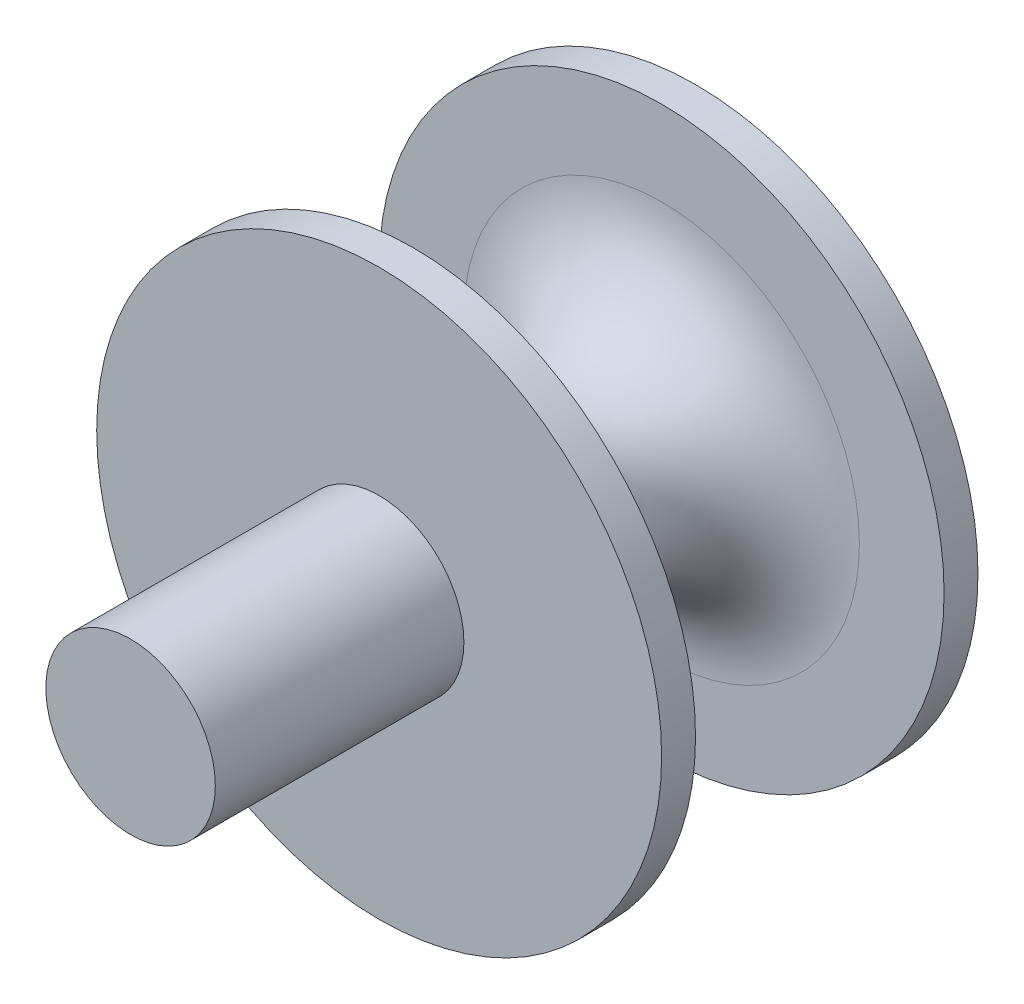
ISO-10303-21;
HEADER;
FILE_DESCRIPTION(('STEP AP214'),'2;1');
FILE_NAME('part.step','',(''),(''),'','','');
FILE_SCHEMA(('AUTOMOTIVE_DESIGN { 1 0 10303 214 1 1 1 1 }'));
ENDSEC;
DATA;
#1=APPLICATION_CONTEXT('core data for automotive mechanical design processes');
#2=APPLICATION_PROTOCOL_DEFINITION('international standard','automotive_design',2000,#1);
#3=PRODUCT_CONTEXT('',#1,'mechanical');
#4=PRODUCT('Part','Part','',(#3));
#5=PRODUCT_RELATED_PRODUCT_CATEGORY('part','',(#4));
#6=PRODUCT_DEFINITION_FORMATION('','',#4);
#7=PRODUCT_DEFINITION_CONTEXT('part definition',#1,'design');
#8=PRODUCT_DEFINITION('design','',#6,#7);
#9=PRODUCT_DEFINITION_SHAPE('','',#8);
#10=(LENGTH_UNIT() NAMED_UNIT(*) SI_UNIT(.MILLI.,.METRE.));
#11=(NAMED_UNIT(*) PLANE_ANGLE_UNIT() SI_UNIT($,.RADIAN.));
#12=(NAMED_UNIT(*) SI_UNIT($,.STERADIAN.) SOLID_ANGLE_UNIT());
#13=UNCERTAINTY_MEASURE_WITH_UNIT(LENGTH_MEASURE(1.E-05),#10,'distance_accuracy_value','');
#14=(GEOMETRIC_REPRESENTATION_CONTEXT(3) GLOBAL_UNCERTAINTY_ASSIGNED_CONTEXT((#13)) GLOBAL_UNIT_ASSIGNED_CONTEXT((#10,
#11,#12)) REPRESENTATION_CONTEXT('',''));
#15=CARTESIAN_POINT('',(0.,0.,0.));
#16=DIRECTION('',(0.,0.,1.));
#17=DIRECTION('',(1.,0.,0.));
#18=AXIS2_PLACEMENT_3D('',#15,#16,#17);
#19=CARTESIAN_POINT('',(0.,0.,50.));
#20=DIRECTION('',(0.,0.,-1.));
#21=DIRECTION('',(-1.,0.,0.));
#22=AXIS2_PLACEMENT_3D('',#19,#20,#21);
#23=CYLINDRICAL_SURFACE('',#22,7.5);
#24=CARTESIAN_POINT('',(0.,0.,13.));
#25=DIRECTION('',(0.,0.,1.));
#26=DIRECTION('',(1.,0.,0.));
#27=AXIS2_PLACEMENT_3D('',#24,#25,#26);
#28=CIRCLE('',#27,7.5);
#29=CARTESIAN_POINT('',(7.5,0.,13.));
#30=VERTEX_POINT('',#29);
#31=EDGE_CURVE('E42',#30,#30,#28,.T.);
#32=ORIENTED_EDGE('',*,*,#31,.T.);
#33=EDGE_LOOP('',(#32));
#34=FACE_BOUND('',#33,.T.);
#35=CARTESIAN_POINT('',(0.,0.,15.));
#36=DIRECTION('',(0.,0.,1.));
#37=DIRECTION('',(1.,0.,0.));
#38=AXIS2_PLACEMENT_3D('',#35,#36,#37);
#39=CIRCLE('',#38,7.5);
#40=CARTESIAN_POINT('',(7.5,0.,15.));
#41=VERTEX_POINT('',#40);
#42=EDGE_CURVE('E46',#41,#41,#39,.F.);
#43=ORIENTED_EDGE('',*,*,#42,.T.);
#44=EDGE_LOOP('',(#43));
#45=FACE_BOUND('',#44,.T.);
#46=ADVANCED_FACE('F31',(#34,#45),#23,.T.);
#47=CARTESIAN_POINT('',(0.,0.,3.));
#48=DIRECTION('',(0.,0.,-1.));
#49=DIRECTION('',(-1.,0.,0.));
#50=AXIS2_PLACEMENT_3D('',#47,#48,#49);
#51=CYLINDRICAL_SURFACE('',#50,25.);
#52=CARTESIAN_POINT('',(0.,0.,3.));
#53=DIRECTION('',(0.,0.,1.));
#54=DIRECTION('',(1.,0.,0.));
#55=AXIS2_PLACEMENT_3D('',#52,#53,#54);
#56=CIRCLE('',#55,25.);
#57=CARTESIAN_POINT('',(25.,0.,3.));
#58=VERTEX_POINT('',#57);
#59=EDGE_CURVE('E59',#58,#58,#56,.T.);
#60=ORIENTED_EDGE('',*,*,#59,.F.);
#61=EDGE_LOOP('',(#60));
#62=FACE_BOUND('',#61,.T.);
#63=CARTESIAN_POINT('',(0.,0.,0.));
#64=DIRECTION('',(0.,0.,1.));
#65=DIRECTION('',(1.,0.,0.));
#66=AXIS2_PLACEMENT_3D('',#63,#64,#65);
#67=CIRCLE('',#66,25.);
#68=CARTESIAN_POINT('',(25.,0.,0.));
#69=VERTEX_POINT('',#68);
#70=EDGE_CURVE('E55',#69,#69,#67,.T.);
#71=ORIENTED_EDGE('',*,*,#70,.T.);
#72=EDGE_LOOP('',(#71));
#73=FACE_BOUND('',#72,.T.);
#74=ADVANCED_FACE('F93',(#62,#73),#51,.T.);
#75=CARTESIAN_POINT('',(0.,0.,3.));
#76=DIRECTION('',(0.,0.,1.));
#77=DIRECTION('',(1.,0.,0.));
#78=AXIS2_PLACEMENT_3D('',#75,#76,#77);
#79=PLANE('',#78);
#80=CARTESIAN_POINT('',(0.,0.,3.));
#81=DIRECTION('',(0.,0.,1.));
#82=DIRECTION('',(1.,0.,0.));
#83=AXIS2_PLACEMENT_3D('',#80,#81,#82);
#84=CIRCLE('',#83,17.5);
#85=CARTESIAN_POINT('',(17.5,0.,3.));
#86=VERTEX_POINT('',#85);
#87=EDGE_CURVE('E38',#86,#86,#84,.F.);
#88=ORIENTED_EDGE('',*,*,#87,.T.);
#89=EDGE_LOOP('',(#88));
#90=FACE_BOUND('',#89,.T.);
#91=ORIENTED_EDGE('',*,*,#59,.T.);
#92=EDGE_LOOP('',(#91));
#93=FACE_BOUND('',#92,.T.);
#94=ADVANCED_FACE('F99',(#90,#93),#79,.T.);
#95=CARTESIAN_POINT('',(0.,0.,0.));
#96=DIRECTION('',(0.,0.,1.));
#97=DIRECTION('',(1.,0.,0.));
#98=AXIS2_PLACEMENT_3D('',#95,#96,#97);
#99=PLANE('',#98);
#100=ORIENTED_EDGE('',*,*,#70,.F.);
#101=EDGE_LOOP('',(#100));
#102=FACE_BOUND('',#101,.T.);
#103=ADVANCED_FACE('F75',(#102),#99,.F.);
#104=CARTESIAN_POINT('',(0.,0.,28.));
#105=DIRECTION('',(0.,0.,-1.));
#106=DIRECTION('',(-1.,0.,0.));
#107=AXIS2_PLACEMENT_3D('',#104,#105,#106);
#108=CYLINDRICAL_SURFACE('',#107,25.);
#109=CARTESIAN_POINT('',(0.,0.,28.));
#110=DIRECTION('',(0.,0.,1.));
#111=DIRECTION('',(1.,0.,0.));
#112=AXIS2_PLACEMENT_3D('',#109,#110,#111);
#113=CIRCLE('',#112,25.);
#114=CARTESIAN_POINT('',(25.,0.,28.));
#115=VERTEX_POINT('',#114);
#116=EDGE_CURVE('E56',#115,#115,#113,.T.);
#117=ORIENTED_EDGE('',*,*,#116,.F.);
#118=EDGE_LOOP('',(#117));
#119=FACE_BOUND('',#118,.T.);
#120=CARTESIAN_POINT('',(0.,0.,25.));
#121=DIRECTION('',(0.,0.,1.));
#122=DIRECTION('',(1.,0.,0.));
#123=AXIS2_PLACEMENT_3D('',#120,#121,#122);
#124=CIRCLE('',#123,25.);
#125=CARTESIAN_POINT('',(25.,0.,25.));
#126=VERTEX_POINT('',#125);
#127=EDGE_CURVE('E64',#126,#126,#124,.T.);
#128=ORIENTED_EDGE('',*,*,#127,.T.);
#129=EDGE_LOOP('',(#128));
#130=FACE_BOUND('',#129,.T.);
#131=ADVANCED_FACE('F72',(#119,#130),#108,.T.);
#132=CARTESIAN_POINT('',(0.,0.,28.));
#133=DIRECTION('',(0.,0.,1.));
#134=DIRECTION('',(1.,0.,0.));
#135=AXIS2_PLACEMENT_3D('',#132,#133,#134);
#136=PLANE('',#135);
#137=CARTESIAN_POINT('',(0.,0.,28.));
#138=DIRECTION('',(0.,0.,1.));
#139=DIRECTION('',(1.,0.,0.));
#140=AXIS2_PLACEMENT_3D('',#137,#138,#139);
#141=CIRCLE('',#140,7.5);
#142=CARTESIAN_POINT('',(7.5,0.,28.));
#143=VERTEX_POINT('',#142);
#144=EDGE_CURVE('E52',#143,#143,#141,.T.);
#145=ORIENTED_EDGE('',*,*,#144,.F.);
#146=EDGE_LOOP('',(#145));
#147=FACE_BOUND('',#146,.T.);
#148=ORIENTED_EDGE('',*,*,#116,.T.);
#149=EDGE_LOOP('',(#148));
#150=FACE_BOUND('',#149,.T.);
#151=ADVANCED_FACE('F70',(#147,#150),#136,.T.);
#152=CARTESIAN_POINT('',(0.,0.,25.));
#153=DIRECTION('',(0.,0.,1.));
#154=DIRECTION('',(1.,0.,0.));
#155=AXIS2_PLACEMENT_3D('',#152,#153,#154);
#156=PLANE('',#155);
#157=CARTESIAN_POINT('',(0.,0.,25.));
#158=DIRECTION('',(0.,0.,1.));
#159=DIRECTION('',(1.,0.,0.));
#160=AXIS2_PLACEMENT_3D('',#157,#158,#159);
#161=CIRCLE('',#160,17.5);
#162=CARTESIAN_POINT('',(17.5,0.,25.));
#163=VERTEX_POINT('',#162);
#164=EDGE_CURVE('E10',#163,#163,#161,.T.);
#165=ORIENTED_EDGE('',*,*,#164,.T.);
#166=EDGE_LOOP('',(#165));
#167=FACE_BOUND('',#166,.T.);
#168=ORIENTED_EDGE('',*,*,#127,.F.);
#169=EDGE_LOOP('',(#168));
#170=FACE_BOUND('',#169,.T.);
#171=ADVANCED_FACE('F79',(#167,#170),#156,.F.);
#172=CARTESIAN_POINT('',(0.,0.,50.));
#173=DIRECTION('',(0.,0.,1.));
#174=DIRECTION('',(1.,0.,0.));
#175=AXIS2_PLACEMENT_3D('',#172,#173,#174);
#176=PLANE('',#175);
#177=CARTESIAN_POINT('',(0.,0.,50.));
#178=DIRECTION('',(0.,0.,1.));
#179=DIRECTION('',(1.,0.,0.));
#180=AXIS2_PLACEMENT_3D('',#177,#178,#179);
#181=CIRCLE('',#180,7.5);
#182=CARTESIAN_POINT('',(7.5,0.,50.));
#183=VERTEX_POINT('',#182);
#184=EDGE_CURVE('E51',#183,#183,#181,.T.);
#185=ORIENTED_EDGE('',*,*,#184,.T.);
#186=EDGE_LOOP('',(#185));
#187=FACE_BOUND('',#186,.T.);
#188=ADVANCED_FACE('F81',(#187),#176,.T.);
#189=ORIENTED_EDGE('',*,*,#144,.T.);
#190=EDGE_LOOP('',(#189));
#191=FACE_BOUND('',#190,.T.);
#192=ORIENTED_EDGE('',*,*,#184,.F.);
#193=EDGE_LOOP('',(#192));
#194=FACE_BOUND('',#193,.T.);
#195=ADVANCED_FACE('F87',(#191,#194),#23,.T.);
#196=CARTESIAN_POINT('',(0.,0.,13.));
#197=DIRECTION('',(0.,0.,1.));
#198=DIRECTION('',(1.,0.,0.));
#199=AXIS2_PLACEMENT_3D('',#196,#197,#198);
#200=TOROIDAL_SURFACE('',#199,17.5,10.);
#201=ORIENTED_EDGE('',*,*,#87,.F.);
#202=EDGE_LOOP('',(#201));
#203=FACE_BOUND('',#202,.T.);
#204=ORIENTED_EDGE('',*,*,#31,.F.);
#205=EDGE_LOOP('',(#204));
#206=FACE_BOUND('',#205,.T.);
#207=ADVANCED_FACE('F105',(#203,#206),#200,.F.);
#208=CARTESIAN_POINT('',(0.,0.,15.));
#209=DIRECTION('',(0.,0.,1.));
#210=DIRECTION('',(1.,0.,0.));
#211=AXIS2_PLACEMENT_3D('',#208,#209,#210);
#212=TOROIDAL_SURFACE('',#211,17.5,10.);
#213=ORIENTED_EDGE('',*,*,#42,.F.);
#214=EDGE_LOOP('',(#213));
#215=FACE_BOUND('',#214,.T.);
#216=ORIENTED_EDGE('',*,*,#164,.F.);
#217=EDGE_LOOP('',(#216));
#218=FACE_BOUND('',#217,.T.);
#219=ADVANCED_FACE('F33',(#215,#218),#212,.F.);
#220=CLOSED_SHELL('',(#46,#74,#94,#103,#131,#151,#171,#188,#195,#207,#219));
#221=MANIFOLD_SOLID_BREP('B2',#220);
#222=ADVANCED_BREP_SHAPE_REPRESENTATION('',(#18,#221),#14);
#223=SHAPE_DEFINITION_REPRESENTATION(#9,#222);
ENDSEC;
END-ISO-10303-21;
